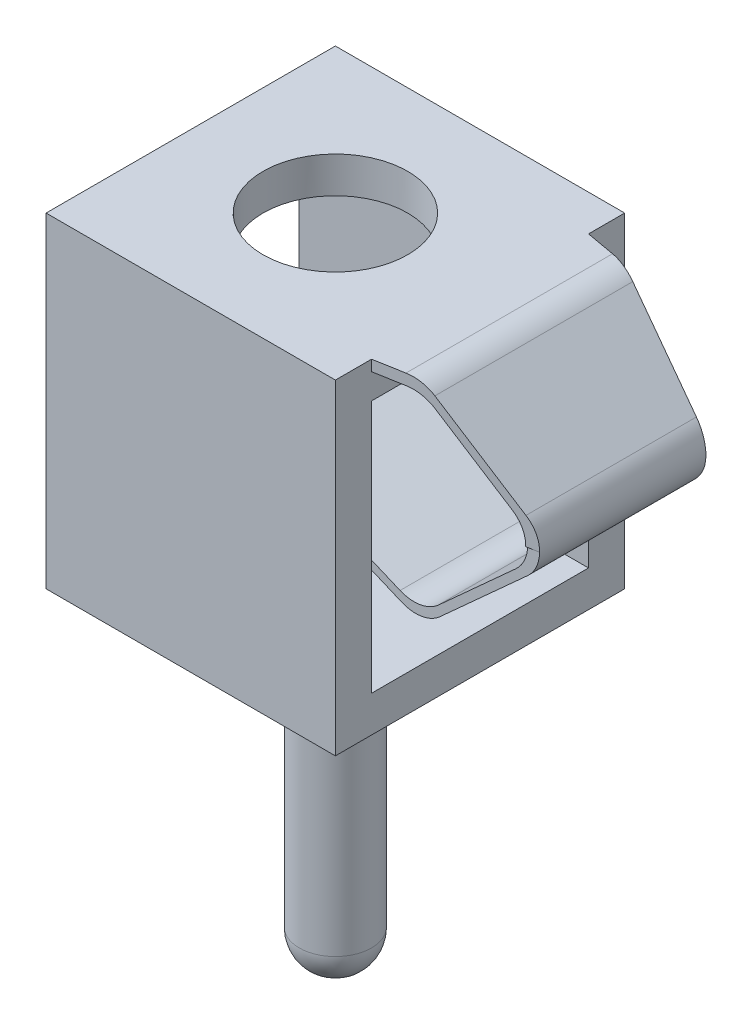
ISO-10303-21;
HEADER;
FILE_DESCRIPTION(('STEP AP214'),'2;1');
FILE_NAME('part.step','',(''),(''),'','','');
FILE_SCHEMA(('AUTOMOTIVE_DESIGN { 1 0 10303 214 1 1 1 1 }'));
ENDSEC;
DATA;
#1=APPLICATION_CONTEXT('core data for automotive mechanical design processes');
#2=APPLICATION_PROTOCOL_DEFINITION('international standard','automotive_design',2000,#1);
#3=PRODUCT_CONTEXT('',#1,'mechanical');
#4=PRODUCT('Part','Part','',(#3));
#5=PRODUCT_RELATED_PRODUCT_CATEGORY('part','',(#4));
#6=PRODUCT_DEFINITION_FORMATION('','',#4);
#7=PRODUCT_DEFINITION_CONTEXT('part definition',#1,'design');
#8=PRODUCT_DEFINITION('design','',#6,#7);
#9=PRODUCT_DEFINITION_SHAPE('','',#8);
#10=(LENGTH_UNIT() NAMED_UNIT(*) SI_UNIT(.MILLI.,.METRE.));
#11=(NAMED_UNIT(*) PLANE_ANGLE_UNIT() SI_UNIT($,.RADIAN.));
#12=(NAMED_UNIT(*) SI_UNIT($,.STERADIAN.) SOLID_ANGLE_UNIT());
#13=UNCERTAINTY_MEASURE_WITH_UNIT(LENGTH_MEASURE(1.E-05),#10,'distance_accuracy_value','');
#14=(GEOMETRIC_REPRESENTATION_CONTEXT(3) GLOBAL_UNCERTAINTY_ASSIGNED_CONTEXT((#13)) GLOBAL_UNIT_ASSIGNED_CONTEXT((#10,
#11,#12)) REPRESENTATION_CONTEXT('',''));
#15=CARTESIAN_POINT('',(0.,0.,0.));
#16=DIRECTION('',(0.,0.,1.));
#17=DIRECTION('',(1.,0.,0.));
#18=AXIS2_PLACEMENT_3D('',#15,#16,#17);
#19=CARTESIAN_POINT('',(5.47325224870173,0.758594498832904,-6.85820493129034));
#20=DIRECTION('',(0.,0.,1.));
#21=DIRECTION('',(1.,0.,0.));
#22=AXIS2_PLACEMENT_3D('',#19,#20,#21);
#23=CYLINDRICAL_SURFACE('',#22,0.500000000000002);
#24=DIRECTION('',(0.,0.,1.));
#25=VECTOR('',#24,1.);
#26=CARTESIAN_POINT('',(5.80889638246924,0.387996312831595,-6.85820493129034));
#27=LINE('',#26,#25);
#28=CARTESIAN_POINT('',(5.80889638246924,0.387996312831597,-1.15001310263475));
#29=VERTEX_POINT('',#28);
#30=CARTESIAN_POINT('',(5.80889638246924,0.387996312831597,1.15001310263475));
#31=VERTEX_POINT('',#30);
#32=EDGE_CURVE('E251',#29,#31,#27,.T.);
#33=ORIENTED_EDGE('',*,*,#32,.F.);
#34=CARTESIAN_POINT('',(5.47325224870173,0.758594498832904,-1.15001310263475));
#35=DIRECTION('',(0.,0.,-1.));
#36=DIRECTION('',(0.,1.,0.));
#37=AXIS2_PLACEMENT_3D('',#34,#35,#36);
#38=CIRCLE('',#37,0.500000000000002);
#39=CARTESIAN_POINT('',(5.97317837783464,0.75,-1.15001310263475));
#40=VERTEX_POINT('',#39);
#41=EDGE_CURVE('E238',#29,#40,#38,.F.);
#42=ORIENTED_EDGE('',*,*,#41,.T.);
#43=CARTESIAN_POINT('',(5.47325224870173,0.758594498832904,-1.23868607655972));
#44=DIRECTION('',(-0.174646166467987,0.,0.984631259171694));
#45=DIRECTION('',(0.984631259171694,0.,0.174646166467987));
#46=AXIS2_PLACEMENT_3D('',#43,#44,#45);
#47=ELLIPSE('',#46,0.507804312876091,0.500000000000002);
#48=CARTESIAN_POINT('',(5.81318688294126,1.12526116549957,-1.17839113856479));
#49=VERTEX_POINT('',#48);
#50=EDGE_CURVE('E248',#49,#40,#47,.F.);
#51=ORIENTED_EDGE('',*,*,#50,.F.);
#52=DIRECTION('',(0.,0.,1.));
#53=VECTOR('',#52,1.);
#54=CARTESIAN_POINT('',(5.81318688294126,1.12526116549957,-6.85820493129034));
#55=LINE('',#54,#53);
#56=CARTESIAN_POINT('',(5.81318688294126,1.12526116549957,1.17839113856479));
#57=VERTEX_POINT('',#56);
#58=EDGE_CURVE('E289',#49,#57,#55,.T.);
#59=ORIENTED_EDGE('',*,*,#58,.T.);
#60=CARTESIAN_POINT('',(5.47325224870173,0.758594498832904,1.23868607655972));
#61=DIRECTION('',(-0.174646166467987,0.,-0.984631259171694));
#62=DIRECTION('',(-0.984631259171694,0.,0.174646166467987));
#63=AXIS2_PLACEMENT_3D('',#60,#61,#62);
#64=ELLIPSE('',#63,0.507804312876091,0.500000000000002);
#65=CARTESIAN_POINT('',(5.97317837783464,0.75,1.15001310263475));
#66=VERTEX_POINT('',#65);
#67=EDGE_CURVE('E579',#66,#57,#64,.F.);
#68=ORIENTED_EDGE('',*,*,#67,.F.);
#69=CARTESIAN_POINT('',(5.47325224870173,0.758594498832904,1.15001310263475));
#70=DIRECTION('',(0.,0.,1.));
#71=DIRECTION('',(0.,-1.,0.));
#72=AXIS2_PLACEMENT_3D('',#69,#70,#71);
#73=CIRCLE('',#72,0.500000000000002);
#74=EDGE_CURVE('E614',#66,#31,#73,.F.);
#75=ORIENTED_EDGE('',*,*,#74,.T.);
#76=EDGE_LOOP('',(#33,#42,#51,#59,#68,#75));
#77=FACE_BOUND('',#76,.T.);
#78=ADVANCED_FACE('F38',(#77),#23,.T.);
#79=CARTESIAN_POINT('',(5.80889638246924,0.387996312831597,-6.85820493129034));
#80=DIRECTION('',(0.671288267535008,-0.741196372002621,0.));
#81=DIRECTION('',(0.741196372002621,0.671288267535008,0.));
#82=AXIS2_PLACEMENT_3D('',#79,#80,#81);
#83=PLANE('',#82);
#84=DIRECTION('',(0.,0.,1.));
#85=VECTOR('',#84,1.);
#86=CARTESIAN_POINT('',(4.59643948633741,-0.710104163653645,-6.85820493129034));
#87=LINE('',#86,#85);
#88=CARTESIAN_POINT('',(4.59643948633741,-0.710104163653642,-1.15001310263475));
#89=VERTEX_POINT('',#88);
#90=CARTESIAN_POINT('',(4.59643948633741,-0.710104163653642,1.15001310263475));
#91=VERTEX_POINT('',#90);
#92=EDGE_CURVE('E294',#89,#91,#87,.T.);
#93=ORIENTED_EDGE('',*,*,#92,.F.);
#94=DIRECTION('',(0.741196372002621,0.671288267535008,0.));
#95=VECTOR('',#94,1.);
#96=CARTESIAN_POINT('',(5.80889638246924,0.387996312831596,-1.15001310263475));
#97=LINE('',#96,#95);
#98=EDGE_CURVE('E253',#89,#29,#97,.T.);
#99=ORIENTED_EDGE('',*,*,#98,.T.);
#100=ORIENTED_EDGE('',*,*,#32,.T.);
#101=DIRECTION('',(-0.741196372002621,-0.671288267535008,0.));
#102=VECTOR('',#101,1.);
#103=CARTESIAN_POINT('',(5.80889638246924,0.387996312831596,1.15001310263475));
#104=LINE('',#103,#102);
#105=EDGE_CURVE('E617',#31,#91,#104,.T.);
#106=ORIENTED_EDGE('',*,*,#105,.T.);
#107=EDGE_LOOP('',(#93,#99,#100,#106));
#108=FACE_BOUND('',#107,.T.);
#109=ADVANCED_FACE('F439',(#108),#83,.T.);
#110=CARTESIAN_POINT('',(4.2607953525699,-0.339505977652333,-6.85820493129034));
#111=DIRECTION('',(0.,0.,1.));
#112=DIRECTION('',(1.,0.,0.));
#113=AXIS2_PLACEMENT_3D('',#110,#111,#112);
#114=CYLINDRICAL_SURFACE('',#113,0.500000000000002);
#115=DIRECTION('',(0.,0.,1.));
#116=VECTOR('',#115,1.);
#117=CARTESIAN_POINT('',(4.06676867111155,-0.800324430931128,-6.85820493129034));
#118=LINE('',#117,#116);
#119=CARTESIAN_POINT('',(4.06676867111155,-0.800324430931124,-1.15001310263475));
#120=VERTEX_POINT('',#119);
#121=CARTESIAN_POINT('',(4.06676867111155,-0.800324430931124,1.15001310263475));
#122=VERTEX_POINT('',#121);
#123=EDGE_CURVE('E297',#120,#122,#118,.T.);
#124=ORIENTED_EDGE('',*,*,#123,.F.);
#125=CARTESIAN_POINT('',(4.2607953525699,-0.339505977652333,-1.15001310263475));
#126=DIRECTION('',(0.,0.,-1.));
#127=DIRECTION('',(0.,1.,0.));
#128=AXIS2_PLACEMENT_3D('',#125,#126,#127);
#129=CIRCLE('',#128,0.500000000000002);
#130=EDGE_CURVE('E547',#120,#89,#129,.F.);
#131=ORIENTED_EDGE('',*,*,#130,.T.);
#132=ORIENTED_EDGE('',*,*,#92,.T.);
#133=CARTESIAN_POINT('',(4.2607953525699,-0.339505977652333,1.15001310263475));
#134=DIRECTION('',(0.,0.,1.));
#135=DIRECTION('',(0.,-1.,0.));
#136=AXIS2_PLACEMENT_3D('',#133,#134,#135);
#137=CIRCLE('',#136,0.500000000000002);
#138=EDGE_CURVE('E620',#91,#122,#137,.F.);
#139=ORIENTED_EDGE('',*,*,#138,.T.);
#140=EDGE_LOOP('',(#124,#131,#132,#139));
#141=FACE_BOUND('',#140,.T.);
#142=ADVANCED_FACE('F444',(#141),#114,.T.);
#143=CARTESIAN_POINT('',(4.06676867111155,-0.800324430931125,-6.85820493129034));
#144=DIRECTION('',(-0.38805336291672,-0.921636906557579,0.));
#145=DIRECTION('',(0.921636906557579,-0.38805336291672,0.));
#146=AXIS2_PLACEMENT_3D('',#143,#144,#145);
#147=PLANE('',#146);
#148=DIRECTION('',(0.,0.,1.));
#149=VECTOR('',#148,1.);
#150=CARTESIAN_POINT('',(1.59543168365403,0.240227029258746,-6.85820493129034));
#151=LINE('',#150,#149);
#152=CARTESIAN_POINT('',(1.59543168365403,0.240227029258746,-1.15001310263475));
#153=VERTEX_POINT('',#152);
#154=CARTESIAN_POINT('',(1.59543168365403,0.240227029258746,1.15001310263475));
#155=VERTEX_POINT('',#154);
#156=EDGE_CURVE('E300',#153,#155,#151,.T.);
#157=ORIENTED_EDGE('',*,*,#156,.F.);
#158=DIRECTION('',(0.921636906557579,-0.38805336291672,0.));
#159=VECTOR('',#158,1.);
#160=CARTESIAN_POINT('',(4.06676867111155,-0.800324430931125,-1.15001310263475));
#161=LINE('',#160,#159);
#162=EDGE_CURVE('E557',#153,#120,#161,.T.);
#163=ORIENTED_EDGE('',*,*,#162,.T.);
#164=ORIENTED_EDGE('',*,*,#123,.T.);
#165=DIRECTION('',(-0.921636906557579,0.38805336291672,0.));
#166=VECTOR('',#165,1.);
#167=CARTESIAN_POINT('',(4.06676867111155,-0.800324430931125,1.15001310263475));
#168=LINE('',#167,#166);
#169=EDGE_CURVE('E624',#122,#155,#168,.T.);
#170=ORIENTED_EDGE('',*,*,#169,.T.);
#171=EDGE_LOOP('',(#157,#163,#164,#170));
#172=FACE_BOUND('',#171,.T.);
#173=ADVANCED_FACE('F453',(#172),#147,.T.);
#174=CARTESIAN_POINT('',(1.59543168365403,0.359579888521796,-6.85820493129034));
#175=DIRECTION('',(-1.,0.,0.));
#176=DIRECTION('',(0.,0.,1.));
#177=AXIS2_PLACEMENT_3D('',#174,#175,#176);
#178=PLANE('',#177);
#179=DIRECTION('',(0.,0.,1.));
#180=VECTOR('',#179,1.);
#181=CARTESIAN_POINT('',(1.59543168365403,0.359579888521796,-6.85820493129034));
#182=LINE('',#181,#180);
#183=CARTESIAN_POINT('',(1.59543168365403,0.359579888521796,-1.15001310263475));
#184=VERTEX_POINT('',#183);
#185=CARTESIAN_POINT('',(1.59543168365403,0.359579888521796,1.15001310263475));
#186=VERTEX_POINT('',#185);
#187=EDGE_CURVE('E303',#184,#186,#182,.T.);
#188=ORIENTED_EDGE('',*,*,#187,.F.);
#189=DIRECTION('',(0.,-1.,0.));
#190=VECTOR('',#189,1.);
#191=CARTESIAN_POINT('',(1.59543168365403,0.359579888521796,-1.15001310263475));
#192=LINE('',#191,#190);
#193=EDGE_CURVE('E559',#184,#153,#192,.T.);
#194=ORIENTED_EDGE('',*,*,#193,.T.);
#195=ORIENTED_EDGE('',*,*,#156,.T.);
#196=DIRECTION('',(0.,1.,0.));
#197=VECTOR('',#196,1.);
#198=CARTESIAN_POINT('',(1.59543168365403,0.359579888521795,1.15001310263475));
#199=LINE('',#198,#197);
#200=EDGE_CURVE('E628',#155,#186,#199,.T.);
#201=ORIENTED_EDGE('',*,*,#200,.T.);
#202=EDGE_LOOP('',(#188,#194,#195,#201));
#203=FACE_BOUND('',#202,.T.);
#204=ADVANCED_FACE('F457',(#203),#178,.T.);
#205=CARTESIAN_POINT('',(4.04486831994504,-0.671750472926527,-6.85820493129034));
#206=DIRECTION('',(0.38805336291672,0.92163690655758,0.));
#207=DIRECTION('',(-0.92163690655758,0.38805336291672,0.));
#208=AXIS2_PLACEMENT_3D('',#205,#206,#207);
#209=PLANE('',#208);
#210=DIRECTION('',(0.,0.,1.));
#211=VECTOR('',#210,1.);
#212=CARTESIAN_POINT('',(4.04486831994504,-0.671750472926527,-6.85820493129034));
#213=LINE('',#212,#211);
#214=CARTESIAN_POINT('',(4.04486831994504,-0.671750472926531,-1.15001310263475));
#215=VERTEX_POINT('',#214);
#216=CARTESIAN_POINT('',(4.04486831994504,-0.67175047292653,1.15001310263475));
#217=VERTEX_POINT('',#216);
#218=EDGE_CURVE('E305',#215,#217,#213,.T.);
#219=ORIENTED_EDGE('',*,*,#218,.F.);
#220=DIRECTION('',(-0.92163690655758,0.38805336291672,0.));
#221=VECTOR('',#220,1.);
#222=CARTESIAN_POINT('',(4.04486831994504,-0.671750472926527,-1.15001310263475));
#223=LINE('',#222,#221);
#224=EDGE_CURVE('E653',#215,#184,#223,.T.);
#225=ORIENTED_EDGE('',*,*,#224,.T.);
#226=ORIENTED_EDGE('',*,*,#187,.T.);
#227=DIRECTION('',(0.92163690655758,-0.38805336291672,0.));
#228=VECTOR('',#227,1.);
#229=CARTESIAN_POINT('',(4.04486831994504,-0.671750472926527,1.15001310263475));
#230=LINE('',#229,#228);
#231=EDGE_CURVE('E568',#186,#217,#230,.T.);
#232=ORIENTED_EDGE('',*,*,#231,.T.);
#233=EDGE_LOOP('',(#219,#225,#226,#232));
#234=FACE_BOUND('',#233,.T.);
#235=ADVANCED_FACE('F461',(#234),#209,.T.);
#236=CARTESIAN_POINT('',(4.23889500140339,-0.210932019647736,-6.85820493129034));
#237=DIRECTION('',(0.,0.,1.));
#238=DIRECTION('',(1.,0.,0.));
#239=AXIS2_PLACEMENT_3D('',#236,#237,#238);
#240=CYLINDRICAL_SURFACE('',#239,0.500000000000002);
#241=DIRECTION('',(0.,0.,1.));
#242=VECTOR('',#241,1.);
#243=CARTESIAN_POINT('',(4.5745391351709,-0.581530205649044,-6.85820493129034));
#244=LINE('',#243,#242);
#245=CARTESIAN_POINT('',(4.5745391351709,-0.58153020564905,-1.15001310263475));
#246=VERTEX_POINT('',#245);
#247=CARTESIAN_POINT('',(4.5745391351709,-0.58153020564905,1.15001310263475));
#248=VERTEX_POINT('',#247);
#249=EDGE_CURVE('E308',#246,#248,#244,.T.);
#250=ORIENTED_EDGE('',*,*,#249,.F.);
#251=CARTESIAN_POINT('',(4.23889500140339,-0.210932019647736,-1.15001310263475));
#252=DIRECTION('',(0.,0.,-1.));
#253=DIRECTION('',(0.,1.,0.));
#254=AXIS2_PLACEMENT_3D('',#251,#252,#253);
#255=CIRCLE('',#254,0.500000000000002);
#256=EDGE_CURVE('E657',#246,#215,#255,.T.);
#257=ORIENTED_EDGE('',*,*,#256,.T.);
#258=ORIENTED_EDGE('',*,*,#218,.T.);
#259=CARTESIAN_POINT('',(4.23889500140339,-0.210932019647736,1.15001310263475));
#260=DIRECTION('',(0.,0.,1.));
#261=DIRECTION('',(0.,-1.,0.));
#262=AXIS2_PLACEMENT_3D('',#259,#260,#261);
#263=CIRCLE('',#262,0.500000000000002);
#264=EDGE_CURVE('E565',#217,#248,#263,.T.);
#265=ORIENTED_EDGE('',*,*,#264,.T.);
#266=EDGE_LOOP('',(#250,#257,#258,#265));
#267=FACE_BOUND('',#266,.T.);
#268=ADVANCED_FACE('F465',(#267),#240,.F.);
#269=CARTESIAN_POINT('',(5.64607854385029,0.388943828518693,-6.85820493129034));
#270=DIRECTION('',(-0.671288267535009,0.74119637200262,0.));
#271=DIRECTION('',(-0.74119637200262,-0.671288267535009,0.));
#272=AXIS2_PLACEMENT_3D('',#269,#270,#271);
#273=PLANE('',#272);
#274=DIRECTION('',(0.,0.,1.));
#275=VECTOR('',#274,1.);
#276=CARTESIAN_POINT('',(5.64607854385029,0.388943828518693,-6.85820493129034));
#277=LINE('',#276,#275);
#278=CARTESIAN_POINT('',(5.64607854385029,0.388943828518692,-1.15001310263475));
#279=VERTEX_POINT('',#278);
#280=CARTESIAN_POINT('',(5.64607854385029,0.388943828518692,1.15001310263475));
#281=VERTEX_POINT('',#280);
#282=EDGE_CURVE('E311',#279,#281,#277,.T.);
#283=ORIENTED_EDGE('',*,*,#282,.F.);
#284=DIRECTION('',(-0.74119637200262,-0.671288267535009,0.));
#285=VECTOR('',#284,1.);
#286=CARTESIAN_POINT('',(5.64607854385029,0.388943828518692,-1.15001310263475));
#287=LINE('',#286,#285);
#288=EDGE_CURVE('E563',#279,#246,#287,.T.);
#289=ORIENTED_EDGE('',*,*,#288,.T.);
#290=ORIENTED_EDGE('',*,*,#249,.T.);
#291=DIRECTION('',(0.74119637200262,0.671288267535009,0.));
#292=VECTOR('',#291,1.);
#293=CARTESIAN_POINT('',(5.64607854385029,0.388943828518692,1.15001310263475));
#294=LINE('',#293,#292);
#295=EDGE_CURVE('E569',#248,#281,#294,.T.);
#296=ORIENTED_EDGE('',*,*,#295,.T.);
#297=EDGE_LOOP('',(#283,#289,#290,#296));
#298=FACE_BOUND('',#297,.T.);
#299=ADVANCED_FACE('F433',(#298),#273,.T.);
#300=CARTESIAN_POINT('',(5.31043441008278,0.759542014520001,-6.85820493129034));
#301=DIRECTION('',(0.,0.,1.));
#302=DIRECTION('',(1.,0.,0.));
#303=AXIS2_PLACEMENT_3D('',#300,#301,#302);
#304=CYLINDRICAL_SURFACE('',#303,0.500000000000002);
#305=DIRECTION('',(0.,0.,1.));
#306=VECTOR('',#305,1.);
#307=CARTESIAN_POINT('',(5.81034335175007,0.75,-6.85820493129034));
#308=LINE('',#307,#306);
#309=CARTESIAN_POINT('',(5.81034335175007,0.75,-1.17889550181463));
#310=VERTEX_POINT('',#309);
#311=CARTESIAN_POINT('',(5.81034335175007,0.75,-1.15001310263475));
#312=VERTEX_POINT('',#311);
#313=EDGE_CURVE('E227',#310,#312,#308,.T.);
#314=ORIENTED_EDGE('',*,*,#313,.T.);
#315=CARTESIAN_POINT('',(5.31043441008278,0.759542014520001,-1.15001310263475));
#316=DIRECTION('',(0.,0.,-1.));
#317=DIRECTION('',(0.,1.,0.));
#318=AXIS2_PLACEMENT_3D('',#315,#316,#317);
#319=CIRCLE('',#318,0.500000000000002);
#320=EDGE_CURVE('E241',#312,#279,#319,.T.);
#321=ORIENTED_EDGE('',*,*,#320,.T.);
#322=ORIENTED_EDGE('',*,*,#282,.T.);
#323=CARTESIAN_POINT('',(5.31043441008278,0.759542014520001,1.15001310263475));
#324=DIRECTION('',(0.,0.,1.));
#325=DIRECTION('',(0.,-1.,0.));
#326=AXIS2_PLACEMENT_3D('',#323,#324,#325);
#327=CIRCLE('',#326,0.500000000000002);
#328=CARTESIAN_POINT('',(5.81034335175007,0.75,1.15001310263475));
#329=VERTEX_POINT('',#328);
#330=EDGE_CURVE('E638',#281,#329,#327,.T.);
#331=ORIENTED_EDGE('',*,*,#330,.T.);
#332=DIRECTION('',(0.,0.,1.));
#333=VECTOR('',#332,1.);
#334=CARTESIAN_POINT('',(5.81034335175007,0.75,-6.85820493129034));
#335=LINE('',#334,#333);
#336=CARTESIAN_POINT('',(5.81034335175007,0.75,1.17889550181463));
#337=VERTEX_POINT('',#336);
#338=EDGE_CURVE('E610',#329,#337,#335,.T.);
#339=ORIENTED_EDGE('',*,*,#338,.T.);
#340=CARTESIAN_POINT('',(5.31043441008278,0.759542014520001,1.26756542716182));
#341=DIRECTION('',(-0.174646166467987,0.,-0.984631259171694));
#342=DIRECTION('',(-0.984631259171694,0.,0.174646166467987));
#343=AXIS2_PLACEMENT_3D('',#340,#341,#342);
#344=ELLIPSE('',#343,0.50780431287609,0.500000000000002);
#345=CARTESIAN_POINT('',(5.65036904432231,1.12620868118667,1.20727048916688));
#346=VERTEX_POINT('',#345);
#347=EDGE_CURVE('E573',#346,#337,#344,.T.);
#348=ORIENTED_EDGE('',*,*,#347,.F.);
#349=DIRECTION('',(0.,0.,1.));
#350=VECTOR('',#349,1.);
#351=CARTESIAN_POINT('',(5.65036904432231,1.12620868118667,-6.85820493129034));
#352=LINE('',#351,#350);
#353=CARTESIAN_POINT('',(5.65036904432231,1.12620868118667,-1.20727048916688));
#354=VERTEX_POINT('',#353);
#355=EDGE_CURVE('E314',#354,#346,#352,.T.);
#356=ORIENTED_EDGE('',*,*,#355,.F.);
#357=CARTESIAN_POINT('',(5.31043441008278,0.759542014520001,-1.26756542716182));
#358=DIRECTION('',(-0.174646166467987,0.,0.984631259171694));
#359=DIRECTION('',(0.984631259171694,0.,0.174646166467987));
#360=AXIS2_PLACEMENT_3D('',#357,#358,#359);
#361=ELLIPSE('',#360,0.50780431287609,0.500000000000002);
#362=EDGE_CURVE('E259',#310,#354,#361,.T.);
#363=ORIENTED_EDGE('',*,*,#362,.F.);
#364=EDGE_LOOP('',(#314,#321,#322,#331,#339,#348,#356,#363));
#365=FACE_BOUND('',#364,.T.);
#366=ADVANCED_FACE('F423',(#365),#304,.F.);
#367=CARTESIAN_POINT('',(4.,-2.25,2.));
#368=DIRECTION('',(0.,1.,0.));
#369=DIRECTION('',(0.,0.,1.));
#370=AXIS2_PLACEMENT_3D('',#367,#368,#369);
#371=PLANE('',#370);
#372=DIRECTION('',(0.,0.,-1.));
#373=VECTOR('',#372,1.);
#374=CARTESIAN_POINT('',(0.,-2.25,2.));
#375=LINE('',#374,#373);
#376=CARTESIAN_POINT('',(0.,-2.25,2.));
#377=VERTEX_POINT('',#376);
#378=CARTESIAN_POINT('',(0.,-2.25,-2.));
#379=VERTEX_POINT('',#378);
#380=EDGE_CURVE('E374',#377,#379,#375,.T.);
#381=ORIENTED_EDGE('',*,*,#380,.T.);
#382=DIRECTION('',(-1.,0.,0.));
#383=VECTOR('',#382,1.);
#384=CARTESIAN_POINT('',(4.,-2.25,-2.));
#385=LINE('',#384,#383);
#386=CARTESIAN_POINT('',(4.,-2.25,-2.));
#387=VERTEX_POINT('',#386);
#388=EDGE_CURVE('E385',#387,#379,#385,.T.);
#389=ORIENTED_EDGE('',*,*,#388,.F.);
#390=DIRECTION('',(0.,0.,-1.));
#391=VECTOR('',#390,1.);
#392=CARTESIAN_POINT('',(4.,-2.25,2.));
#393=LINE('',#392,#391);
#394=CARTESIAN_POINT('',(4.,-2.25,2.));
#395=VERTEX_POINT('',#394);
#396=EDGE_CURVE('E382',#395,#387,#393,.T.);
#397=ORIENTED_EDGE('',*,*,#396,.F.);
#398=DIRECTION('',(-1.,0.,0.));
#399=VECTOR('',#398,1.);
#400=CARTESIAN_POINT('',(4.,-2.25,2.));
#401=LINE('',#400,#399);
#402=EDGE_CURVE('E400',#395,#377,#401,.T.);
#403=ORIENTED_EDGE('',*,*,#402,.T.);
#404=EDGE_LOOP('',(#381,#389,#397,#403));
#405=FACE_BOUND('',#404,.T.);
#406=CARTESIAN_POINT('',(2.,-2.25,0.));
#407=DIRECTION('',(0.,1.,0.));
#408=DIRECTION('',(0.,0.,1.));
#409=AXIS2_PLACEMENT_3D('',#406,#407,#408);
#410=CIRCLE('',#409,0.5);
#411=CARTESIAN_POINT('',(2.,-2.25,0.5));
#412=VERTEX_POINT('',#411);
#413=EDGE_CURVE('E48',#412,#412,#410,.F.);
#414=ORIENTED_EDGE('',*,*,#413,.F.);
#415=EDGE_LOOP('',(#414));
#416=FACE_BOUND('',#415,.T.);
#417=ADVANCED_FACE('F420',(#405,#416),#371,.F.);
#418=CARTESIAN_POINT('',(4.,0.,0.));
#419=DIRECTION('',(1.,0.,0.));
#420=DIRECTION('',(0.,0.,-1.));
#421=AXIS2_PLACEMENT_3D('',#418,#419,#420);
#422=PLANE('',#421);
#423=DIRECTION('',(0.,0.,1.));
#424=VECTOR('',#423,1.);
#425=CARTESIAN_POINT('',(4.,2.1,-6.85820493129034));
#426=LINE('',#425,#424);
#427=CARTESIAN_POINT('',(4.,2.1,-1.5));
#428=VERTEX_POINT('',#427);
#429=CARTESIAN_POINT('',(4.,2.1,1.5));
#430=VERTEX_POINT('',#429);
#431=EDGE_CURVE('E281',#428,#430,#426,.T.);
#432=ORIENTED_EDGE('',*,*,#431,.T.);
#433=DIRECTION('',(0.,-1.,0.));
#434=VECTOR('',#433,1.);
#435=CARTESIAN_POINT('',(4.,2.25,1.5));
#436=LINE('',#435,#434);
#437=CARTESIAN_POINT('',(4.,2.25,1.5));
#438=VERTEX_POINT('',#437);
#439=EDGE_CURVE('E273',#438,#430,#436,.T.);
#440=ORIENTED_EDGE('',*,*,#439,.F.);
#441=DIRECTION('',(0.,0.,1.));
#442=VECTOR('',#441,1.);
#443=CARTESIAN_POINT('',(4.,2.25,2.));
#444=LINE('',#443,#442);
#445=CARTESIAN_POINT('',(4.,2.25,2.));
#446=VERTEX_POINT('',#445);
#447=EDGE_CURVE('E373',#438,#446,#444,.T.);
#448=ORIENTED_EDGE('',*,*,#447,.T.);
#449=DIRECTION('',(0.,-1.,0.));
#450=VECTOR('',#449,1.);
#451=CARTESIAN_POINT('',(4.,2.25,2.));
#452=LINE('',#451,#450);
#453=EDGE_CURVE('E379',#446,#395,#452,.T.);
#454=ORIENTED_EDGE('',*,*,#453,.T.);
#455=ORIENTED_EDGE('',*,*,#396,.T.);
#456=DIRECTION('',(0.,1.,0.));
#457=VECTOR('',#456,1.);
#458=CARTESIAN_POINT('',(4.,2.25,-2.));
#459=LINE('',#458,#457);
#460=CARTESIAN_POINT('',(4.,2.25,-2.));
#461=VERTEX_POINT('',#460);
#462=EDGE_CURVE('E369',#387,#461,#459,.T.);
#463=ORIENTED_EDGE('',*,*,#462,.T.);
#464=CARTESIAN_POINT('',(4.,2.25,-1.5));
#465=VERTEX_POINT('',#464);
#466=EDGE_CURVE('E375',#461,#465,#444,.T.);
#467=ORIENTED_EDGE('',*,*,#466,.T.);
#468=DIRECTION('',(0.,1.,0.));
#469=VECTOR('',#468,1.);
#470=CARTESIAN_POINT('',(4.,2.25,-1.5));
#471=LINE('',#470,#469);
#472=EDGE_CURVE('E274',#428,#465,#471,.T.);
#473=ORIENTED_EDGE('',*,*,#472,.F.);
#474=EDGE_LOOP('',(#432,#440,#448,#454,#455,#463,#467,#473));
#475=FACE_BOUND('',#474,.T.);
#476=DIRECTION('',(0.,0.,1.));
#477=VECTOR('',#476,1.);
#478=CARTESIAN_POINT('',(4.,1.75,1.5));
#479=LINE('',#478,#477);
#480=CARTESIAN_POINT('',(4.,1.75,-1.5));
#481=VERTEX_POINT('',#480);
#482=CARTESIAN_POINT('',(4.,1.75,1.5));
#483=VERTEX_POINT('',#482);
#484=EDGE_CURVE('E335',#481,#483,#479,.T.);
#485=ORIENTED_EDGE('',*,*,#484,.F.);
#486=DIRECTION('',(0.,1.,0.));
#487=VECTOR('',#486,1.);
#488=CARTESIAN_POINT('',(4.,1.75,-1.5));
#489=LINE('',#488,#487);
#490=CARTESIAN_POINT('',(4.,-1.75,-1.5));
#491=VERTEX_POINT('',#490);
#492=EDGE_CURVE('E332',#491,#481,#489,.T.);
#493=ORIENTED_EDGE('',*,*,#492,.F.);
#494=DIRECTION('',(0.,0.,-1.));
#495=VECTOR('',#494,1.);
#496=CARTESIAN_POINT('',(4.,-1.75,1.5));
#497=LINE('',#496,#495);
#498=CARTESIAN_POINT('',(4.,-1.75,1.5));
#499=VERTEX_POINT('',#498);
#500=EDGE_CURVE('E341',#499,#491,#497,.T.);
#501=ORIENTED_EDGE('',*,*,#500,.F.);
#502=DIRECTION('',(0.,-1.,0.));
#503=VECTOR('',#502,1.);
#504=CARTESIAN_POINT('',(4.,1.75,1.5));
#505=LINE('',#504,#503);
#506=EDGE_CURVE('E55',#483,#499,#505,.T.);
#507=ORIENTED_EDGE('',*,*,#506,.F.);
#508=EDGE_LOOP('',(#485,#493,#501,#507));
#509=FACE_BOUND('',#508,.T.);
#510=ADVANCED_FACE('F422',(#475,#509),#422,.T.);
#511=CARTESIAN_POINT('',(0.,0.,0.));
#512=DIRECTION('',(1.,0.,0.));
#513=DIRECTION('',(0.,0.,-1.));
#514=AXIS2_PLACEMENT_3D('',#511,#512,#513);
#515=PLANE('',#514);
#516=DIRECTION('',(0.,1.,0.));
#517=VECTOR('',#516,1.);
#518=CARTESIAN_POINT('',(0.,2.25,-2.));
#519=LINE('',#518,#517);
#520=CARTESIAN_POINT('',(0.,2.25,-2.));
#521=VERTEX_POINT('',#520);
#522=EDGE_CURVE('E368',#379,#521,#519,.T.);
#523=ORIENTED_EDGE('',*,*,#522,.F.);
#524=ORIENTED_EDGE('',*,*,#380,.F.);
#525=DIRECTION('',(0.,-1.,0.));
#526=VECTOR('',#525,1.);
#527=CARTESIAN_POINT('',(0.,2.25,2.));
#528=LINE('',#527,#526);
#529=CARTESIAN_POINT('',(0.,2.25,2.));
#530=VERTEX_POINT('',#529);
#531=EDGE_CURVE('E392',#530,#377,#528,.T.);
#532=ORIENTED_EDGE('',*,*,#531,.F.);
#533=DIRECTION('',(0.,0.,1.));
#534=VECTOR('',#533,1.);
#535=CARTESIAN_POINT('',(0.,2.25,2.));
#536=LINE('',#535,#534);
#537=EDGE_CURVE('E389',#521,#530,#536,.T.);
#538=ORIENTED_EDGE('',*,*,#537,.F.);
#539=EDGE_LOOP('',(#523,#524,#532,#538));
#540=FACE_BOUND('',#539,.T.);
#541=DIRECTION('',(0.,1.,0.));
#542=VECTOR('',#541,1.);
#543=CARTESIAN_POINT('',(0.,1.75,-1.5));
#544=LINE('',#543,#542);
#545=CARTESIAN_POINT('',(0.,-1.75,-1.5));
#546=VERTEX_POINT('',#545);
#547=CARTESIAN_POINT('',(0.,1.75,-1.5));
#548=VERTEX_POINT('',#547);
#549=EDGE_CURVE('E63',#546,#548,#544,.T.);
#550=ORIENTED_EDGE('',*,*,#549,.T.);
#551=DIRECTION('',(0.,0.,1.));
#552=VECTOR('',#551,1.);
#553=CARTESIAN_POINT('',(0.,1.75,1.5));
#554=LINE('',#553,#552);
#555=CARTESIAN_POINT('',(0.,1.75,1.5));
#556=VERTEX_POINT('',#555);
#557=EDGE_CURVE('E347',#548,#556,#554,.T.);
#558=ORIENTED_EDGE('',*,*,#557,.T.);
#559=DIRECTION('',(0.,-1.,0.));
#560=VECTOR('',#559,1.);
#561=CARTESIAN_POINT('',(0.,1.75,1.5));
#562=LINE('',#561,#560);
#563=CARTESIAN_POINT('',(0.,-1.75,1.5));
#564=VERTEX_POINT('',#563);
#565=EDGE_CURVE('E351',#556,#564,#562,.T.);
#566=ORIENTED_EDGE('',*,*,#565,.T.);
#567=DIRECTION('',(0.,0.,-1.));
#568=VECTOR('',#567,1.);
#569=CARTESIAN_POINT('',(0.,-1.75,1.5));
#570=LINE('',#569,#568);
#571=EDGE_CURVE('E336',#564,#546,#570,.T.);
#572=ORIENTED_EDGE('',*,*,#571,.T.);
#573=EDGE_LOOP('',(#550,#558,#566,#572));
#574=FACE_BOUND('',#573,.T.);
#575=ADVANCED_FACE('F430',(#540,#574),#515,.F.);
#576=CARTESIAN_POINT('',(4.,2.25,-2.));
#577=DIRECTION('',(0.,0.,1.));
#578=DIRECTION('',(0.,-1.,0.));
#579=AXIS2_PLACEMENT_3D('',#576,#577,#578);
#580=PLANE('',#579);
#581=ORIENTED_EDGE('',*,*,#522,.T.);
#582=DIRECTION('',(-1.,0.,0.));
#583=VECTOR('',#582,1.);
#584=CARTESIAN_POINT('',(4.,2.25,-2.));
#585=LINE('',#584,#583);
#586=EDGE_CURVE('E408',#461,#521,#585,.T.);
#587=ORIENTED_EDGE('',*,*,#586,.F.);
#588=ORIENTED_EDGE('',*,*,#462,.F.);
#589=ORIENTED_EDGE('',*,*,#388,.T.);
#590=EDGE_LOOP('',(#581,#587,#588,#589));
#591=FACE_BOUND('',#590,.T.);
#592=ADVANCED_FACE('F508',(#591),#580,.F.);
#593=CARTESIAN_POINT('',(4.,2.25,2.));
#594=DIRECTION('',(0.,-1.,0.));
#595=DIRECTION('',(0.,0.,-1.));
#596=AXIS2_PLACEMENT_3D('',#593,#594,#595);
#597=PLANE('',#596);
#598=CARTESIAN_POINT('',(2.,2.25,0.));
#599=DIRECTION('',(0.,1.,0.));
#600=DIRECTION('',(0.,0.,1.));
#601=AXIS2_PLACEMENT_3D('',#598,#599,#600);
#602=CIRCLE('',#601,1.);
#603=CARTESIAN_POINT('',(2.,2.25,1.));
#604=VERTEX_POINT('',#603);
#605=EDGE_CURVE('E277',#604,#604,#602,.T.);
#606=ORIENTED_EDGE('',*,*,#605,.F.);
#607=EDGE_LOOP('',(#606));
#608=FACE_BOUND('',#607,.T.);
#609=ORIENTED_EDGE('',*,*,#447,.F.);
#610=DIRECTION('',(-0.984631259171694,0.,0.174646166467987));
#611=VECTOR('',#610,1.);
#612=CARTESIAN_POINT('',(4.,2.25,1.5));
#613=LINE('',#612,#611);
#614=CARTESIAN_POINT('',(4.40388386486181,2.25,1.42836224927926));
#615=VERTEX_POINT('',#614);
#616=EDGE_CURVE('E552',#615,#438,#613,.T.);
#617=ORIENTED_EDGE('',*,*,#616,.F.);
#618=DIRECTION('',(0.,0.,1.));
#619=VECTOR('',#618,1.);
#620=CARTESIAN_POINT('',(4.40388386486181,2.25,-6.85820493129034));
#621=LINE('',#620,#619);
#622=CARTESIAN_POINT('',(4.40388386486181,2.25,-1.42836224927926));
#623=VERTEX_POINT('',#622);
#624=EDGE_CURVE('E278',#623,#615,#621,.T.);
#625=ORIENTED_EDGE('',*,*,#624,.F.);
#626=DIRECTION('',(0.984631259171694,0.,0.174646166467987));
#627=VECTOR('',#626,1.);
#628=CARTESIAN_POINT('',(4.,2.25,-1.5));
#629=LINE('',#628,#627);
#630=EDGE_CURVE('E233',#465,#623,#629,.T.);
#631=ORIENTED_EDGE('',*,*,#630,.F.);
#632=ORIENTED_EDGE('',*,*,#466,.F.);
#633=ORIENTED_EDGE('',*,*,#586,.T.);
#634=ORIENTED_EDGE('',*,*,#537,.T.);
#635=DIRECTION('',(-1.,0.,0.));
#636=VECTOR('',#635,1.);
#637=CARTESIAN_POINT('',(4.,2.25,2.));
#638=LINE('',#637,#636);
#639=EDGE_CURVE('E404',#446,#530,#638,.T.);
#640=ORIENTED_EDGE('',*,*,#639,.F.);
#641=EDGE_LOOP('',(#609,#617,#625,#631,#632,#633,#634,#640));
#642=FACE_BOUND('',#641,.T.);
#643=ADVANCED_FACE('F513',(#608,#642),#597,.F.);
#644=CARTESIAN_POINT('',(4.,2.25,2.));
#645=DIRECTION('',(0.,0.,-1.));
#646=DIRECTION('',(0.,1.,0.));
#647=AXIS2_PLACEMENT_3D('',#644,#645,#646);
#648=PLANE('',#647);
#649=ORIENTED_EDGE('',*,*,#531,.T.);
#650=ORIENTED_EDGE('',*,*,#402,.F.);
#651=ORIENTED_EDGE('',*,*,#453,.F.);
#652=ORIENTED_EDGE('',*,*,#639,.T.);
#653=EDGE_LOOP('',(#649,#650,#651,#652));
#654=FACE_BOUND('',#653,.T.);
#655=ADVANCED_FACE('F506',(#654),#648,.F.);
#656=CARTESIAN_POINT('',(4.,1.75,-1.5));
#657=DIRECTION('',(0.,0.,1.));
#658=DIRECTION('',(0.,-1.,0.));
#659=AXIS2_PLACEMENT_3D('',#656,#657,#658);
#660=PLANE('',#659);
#661=DIRECTION('',(-1.,0.,0.));
#662=VECTOR('',#661,1.);
#663=CARTESIAN_POINT('',(4.,1.75,-1.5));
#664=LINE('',#663,#662);
#665=EDGE_CURVE('E365',#481,#548,#664,.T.);
#666=ORIENTED_EDGE('',*,*,#665,.T.);
#667=ORIENTED_EDGE('',*,*,#549,.F.);
#668=DIRECTION('',(-1.,0.,0.));
#669=VECTOR('',#668,1.);
#670=CARTESIAN_POINT('',(4.,-1.75,-1.5));
#671=LINE('',#670,#669);
#672=EDGE_CURVE('E344',#491,#546,#671,.T.);
#673=ORIENTED_EDGE('',*,*,#672,.F.);
#674=ORIENTED_EDGE('',*,*,#492,.T.);
#675=EDGE_LOOP('',(#666,#667,#673,#674));
#676=FACE_BOUND('',#675,.T.);
#677=ADVANCED_FACE('F503',(#676),#660,.T.);
#678=CARTESIAN_POINT('',(4.,1.75,1.5));
#679=DIRECTION('',(0.,-1.,0.));
#680=DIRECTION('',(0.,0.,-1.));
#681=AXIS2_PLACEMENT_3D('',#678,#679,#680);
#682=PLANE('',#681);
#683=CARTESIAN_POINT('',(2.,1.75,0.));
#684=DIRECTION('',(0.,-1.,0.));
#685=DIRECTION('',(0.,0.,-1.));
#686=AXIS2_PLACEMENT_3D('',#683,#684,#685);
#687=CIRCLE('',#686,1.);
#688=CARTESIAN_POINT('',(2.,1.75,-1.));
#689=VERTEX_POINT('',#688);
#690=EDGE_CURVE('E42',#689,#689,#687,.T.);
#691=ORIENTED_EDGE('',*,*,#690,.F.);
#692=EDGE_LOOP('',(#691));
#693=FACE_BOUND('',#692,.T.);
#694=ORIENTED_EDGE('',*,*,#557,.F.);
#695=ORIENTED_EDGE('',*,*,#665,.F.);
#696=ORIENTED_EDGE('',*,*,#484,.T.);
#697=DIRECTION('',(-1.,0.,0.));
#698=VECTOR('',#697,1.);
#699=CARTESIAN_POINT('',(4.,1.75,1.5));
#700=LINE('',#699,#698);
#701=EDGE_CURVE('E362',#483,#556,#700,.T.);
#702=ORIENTED_EDGE('',*,*,#701,.T.);
#703=EDGE_LOOP('',(#694,#695,#696,#702));
#704=FACE_BOUND('',#703,.T.);
#705=ADVANCED_FACE('F500',(#693,#704),#682,.T.);
#706=CARTESIAN_POINT('',(4.,1.75,1.5));
#707=DIRECTION('',(0.,0.,-1.));
#708=DIRECTION('',(0.,1.,0.));
#709=AXIS2_PLACEMENT_3D('',#706,#707,#708);
#710=PLANE('',#709);
#711=ORIENTED_EDGE('',*,*,#506,.T.);
#712=DIRECTION('',(-1.,0.,0.));
#713=VECTOR('',#712,1.);
#714=CARTESIAN_POINT('',(4.,-1.75,1.5));
#715=LINE('',#714,#713);
#716=EDGE_CURVE('E359',#499,#564,#715,.T.);
#717=ORIENTED_EDGE('',*,*,#716,.T.);
#718=ORIENTED_EDGE('',*,*,#565,.F.);
#719=ORIENTED_EDGE('',*,*,#701,.F.);
#720=EDGE_LOOP('',(#711,#717,#718,#719));
#721=FACE_BOUND('',#720,.T.);
#722=ADVANCED_FACE('F496',(#721),#710,.T.);
#723=CARTESIAN_POINT('',(4.,-1.75,1.5));
#724=DIRECTION('',(0.,1.,0.));
#725=DIRECTION('',(0.,0.,1.));
#726=AXIS2_PLACEMENT_3D('',#723,#724,#725);
#727=PLANE('',#726);
#728=ORIENTED_EDGE('',*,*,#571,.F.);
#729=ORIENTED_EDGE('',*,*,#716,.F.);
#730=ORIENTED_EDGE('',*,*,#500,.T.);
#731=ORIENTED_EDGE('',*,*,#672,.T.);
#732=EDGE_LOOP('',(#728,#729,#730,#731));
#733=FACE_BOUND('',#732,.T.);
#734=ADVANCED_FACE('F492',(#733),#727,.T.);
#735=CARTESIAN_POINT('',(2.,-6.8,0.));
#736=DIRECTION('',(0.,1.,0.));
#737=DIRECTION('',(0.,0.,1.));
#738=AXIS2_PLACEMENT_3D('',#735,#736,#737);
#739=CYLINDRICAL_SURFACE('',#738,0.5);
#740=CARTESIAN_POINT('',(2.,-6.3,0.));
#741=DIRECTION('',(0.,1.,0.));
#742=DIRECTION('',(0.,0.,1.));
#743=AXIS2_PLACEMENT_3D('',#740,#741,#742);
#744=CIRCLE('',#743,0.5);
#745=CARTESIAN_POINT('',(2.,-6.3,0.5));
#746=VERTEX_POINT('',#745);
#747=EDGE_CURVE('E11',#746,#746,#744,.T.);
#748=ORIENTED_EDGE('',*,*,#747,.T.);
#749=EDGE_LOOP('',(#748));
#750=FACE_BOUND('',#749,.T.);
#751=ORIENTED_EDGE('',*,*,#413,.T.);
#752=EDGE_LOOP('',(#751));
#753=FACE_BOUND('',#752,.T.);
#754=ADVANCED_FACE('F418',(#750,#753),#739,.T.);
#755=CARTESIAN_POINT('',(2.,-6.3,0.));
#756=DIRECTION('',(0.,0.,1.));
#757=DIRECTION('',(1.,0.,0.));
#758=AXIS2_PLACEMENT_3D('',#755,#756,#757);
#759=SPHERICAL_SURFACE('',#758,0.5);
#760=CARTESIAN_POINT('',(2.,-6.3,0.));
#761=DIRECTION('',(0.,1.,0.));
#762=DIRECTION('',(0.,0.,1.));
#763=AXIS2_PLACEMENT_3D('',#760,#761,#762);
#764=SPHERICAL_SURFACE('',#763,0.5);
#765=ORIENTED_EDGE('',*,*,#747,.F.);
#766=EDGE_LOOP('',(#765));
#767=FACE_BOUND('',#766,.T.);
#768=ADVANCED_FACE('F40',(#767),#764,.T.);
#769=CARTESIAN_POINT('',(2.,-0.3,0.));
#770=DIRECTION('',(0.,1.,0.));
#771=DIRECTION('',(0.,0.,1.));
#772=AXIS2_PLACEMENT_3D('',#769,#770,#771);
#773=CYLINDRICAL_SURFACE('',#772,1.);
#774=ORIENTED_EDGE('',*,*,#690,.T.);
#775=EDGE_LOOP('',(#774));
#776=FACE_BOUND('',#775,.T.);
#777=ORIENTED_EDGE('',*,*,#605,.T.);
#778=EDGE_LOOP('',(#777));
#779=FACE_BOUND('',#778,.T.);
#780=ADVANCED_FACE('F485',(#776,#779),#773,.F.);
#781=CARTESIAN_POINT('',(4.40388386486181,1.75,-6.85820493129034));
#782=DIRECTION('',(0.,0.,1.));
#783=DIRECTION('',(1.,0.,0.));
#784=AXIS2_PLACEMENT_3D('',#781,#782,#783);
#785=CYLINDRICAL_SURFACE('',#784,0.5);
#786=CARTESIAN_POINT('',(4.40388386486181,1.75,1.42836224927926));
#787=DIRECTION('',(-0.174646166467987,0.,-0.984631259171694));
#788=DIRECTION('',(-0.984631259171694,0.,0.174646166467987));
#789=AXIS2_PLACEMENT_3D('',#786,#787,#788);
#790=ELLIPSE('',#789,0.507804312876089,0.5);
#791=CARTESIAN_POINT('',(4.74381849910133,2.11666666666666,1.36806731128433));
#792=VERTEX_POINT('',#791);
#793=EDGE_CURVE('E572',#792,#615,#790,.F.);
#794=ORIENTED_EDGE('',*,*,#793,.F.);
#795=DIRECTION('',(0.,0.,1.));
#796=VECTOR('',#795,1.);
#797=CARTESIAN_POINT('',(4.74381849910133,2.11666666666667,-6.85820493129034));
#798=LINE('',#797,#796);
#799=CARTESIAN_POINT('',(4.74381849910133,2.11666666666666,-1.36806731128433));
#800=VERTEX_POINT('',#799);
#801=EDGE_CURVE('E285',#800,#792,#798,.T.);
#802=ORIENTED_EDGE('',*,*,#801,.F.);
#803=CARTESIAN_POINT('',(4.40388386486181,1.75,-1.42836224927926));
#804=DIRECTION('',(-0.174646166467987,0.,0.984631259171694));
#805=DIRECTION('',(0.984631259171694,0.,0.174646166467987));
#806=AXIS2_PLACEMENT_3D('',#803,#804,#805);
#807=ELLIPSE('',#806,0.507804312876089,0.5);
#808=EDGE_CURVE('E264',#623,#800,#807,.F.);
#809=ORIENTED_EDGE('',*,*,#808,.F.);
#810=ORIENTED_EDGE('',*,*,#624,.T.);
#811=EDGE_LOOP('',(#794,#802,#809,#810));
#812=FACE_BOUND('',#811,.T.);
#813=ADVANCED_FACE('F488',(#812),#785,.T.);
#814=CARTESIAN_POINT('',(4.74381849910133,2.11666666666667,-6.85820493129034));
#815=DIRECTION('',(0.679869268479043,0.733333333333329,0.));
#816=DIRECTION('',(-0.733333333333329,0.679869268479043,0.));
#817=AXIS2_PLACEMENT_3D('',#814,#815,#816);
#818=PLANE('',#817);
#819=DIRECTION('',(-0.727207339164334,0.67418989324125,0.128986331511836));
#820=VECTOR('',#819,1.);
#821=CARTESIAN_POINT('',(5.51544124718617,1.40129949400908,1.23120292306058));
#822=LINE('',#821,#820);
#823=EDGE_CURVE('E571',#57,#792,#822,.T.);
#824=ORIENTED_EDGE('',*,*,#823,.F.);
#825=ORIENTED_EDGE('',*,*,#58,.F.);
#826=DIRECTION('',(0.727207339164334,-0.67418989324125,0.128986331511836));
#827=VECTOR('',#826,1.);
#828=CARTESIAN_POINT('',(4.22884465034051,2.59409606736147,-1.45940933163924));
#829=LINE('',#828,#827);
#830=EDGE_CURVE('E257',#800,#49,#829,.T.);
#831=ORIENTED_EDGE('',*,*,#830,.F.);
#832=ORIENTED_EDGE('',*,*,#801,.T.);
#833=EDGE_LOOP('',(#824,#825,#831,#832));
#834=FACE_BOUND('',#833,.T.);
#835=ADVANCED_FACE('F448',(#834),#818,.T.);
#836=CARTESIAN_POINT('',(4.74381849910133,1.96666666666666,-6.85820493129034));
#837=DIRECTION('',(-0.679869268479043,-0.733333333333329,0.));
#838=DIRECTION('',(0.733333333333329,-0.679869268479043,0.));
#839=AXIS2_PLACEMENT_3D('',#836,#837,#838);
#840=PLANE('',#839);
#841=DIRECTION('',(0.727207339164334,-0.67418989324125,-0.128986331511836));
#842=VECTOR('',#841,1.);
#843=CARTESIAN_POINT('',(5.51544124718617,1.25129949400908,1.23120292306058));
#844=LINE('',#843,#842);
#845=CARTESIAN_POINT('',(4.74381849910133,1.96666666666666,1.36806731128433));
#846=VERTEX_POINT('',#845);
#847=EDGE_CURVE('E583',#846,#346,#844,.T.);
#848=ORIENTED_EDGE('',*,*,#847,.F.);
#849=DIRECTION('',(0.,0.,1.));
#850=VECTOR('',#849,1.);
#851=CARTESIAN_POINT('',(4.74381849910133,1.96666666666666,-6.85820493129034));
#852=LINE('',#851,#850);
#853=CARTESIAN_POINT('',(4.74381849910133,1.96666666666666,-1.36806731128433));
#854=VERTEX_POINT('',#853);
#855=EDGE_CURVE('E318',#854,#846,#852,.T.);
#856=ORIENTED_EDGE('',*,*,#855,.F.);
#857=DIRECTION('',(-0.727207339164334,0.67418989324125,-0.128986331511836));
#858=VECTOR('',#857,1.);
#859=CARTESIAN_POINT('',(4.22884465034051,2.44409606736147,-1.45940933163924));
#860=LINE('',#859,#858);
#861=EDGE_CURVE('E267',#354,#854,#860,.T.);
#862=ORIENTED_EDGE('',*,*,#861,.F.);
#863=ORIENTED_EDGE('',*,*,#355,.T.);
#864=EDGE_LOOP('',(#848,#856,#862,#863));
#865=FACE_BOUND('',#864,.T.);
#866=ADVANCED_FACE('F473',(#865),#840,.T.);
#867=CARTESIAN_POINT('',(4.40388386486181,1.6,-6.85820493129034));
#868=DIRECTION('',(0.,0.,1.));
#869=DIRECTION('',(1.,0.,0.));
#870=AXIS2_PLACEMENT_3D('',#867,#868,#869);
#871=CYLINDRICAL_SURFACE('',#870,0.5);
#872=CARTESIAN_POINT('',(4.40388386486181,1.6,1.42836224927926));
#873=DIRECTION('',(-0.174646166467987,0.,-0.984631259171694));
#874=DIRECTION('',(-0.984631259171694,0.,0.174646166467987));
#875=AXIS2_PLACEMENT_3D('',#872,#873,#874);
#876=ELLIPSE('',#875,0.507804312876088,0.5);
#877=CARTESIAN_POINT('',(4.40388386486181,2.1,1.42836224927926));
#878=VERTEX_POINT('',#877);
#879=EDGE_CURVE('E603',#878,#846,#876,.T.);
#880=ORIENTED_EDGE('',*,*,#879,.F.);
#881=DIRECTION('',(0.,0.,1.));
#882=VECTOR('',#881,1.);
#883=CARTESIAN_POINT('',(4.40388386486181,2.1,-6.85820493129034));
#884=LINE('',#883,#882);
#885=CARTESIAN_POINT('',(4.40388386486181,2.1,-1.42836224927926));
#886=VERTEX_POINT('',#885);
#887=EDGE_CURVE('E322',#886,#878,#884,.T.);
#888=ORIENTED_EDGE('',*,*,#887,.F.);
#889=CARTESIAN_POINT('',(4.40388386486181,1.6,-1.42836224927926));
#890=DIRECTION('',(-0.174646166467987,0.,0.984631259171694));
#891=DIRECTION('',(0.984631259171694,0.,0.174646166467987));
#892=AXIS2_PLACEMENT_3D('',#889,#890,#891);
#893=ELLIPSE('',#892,0.507804312876088,0.5);
#894=EDGE_CURVE('E554',#854,#886,#893,.T.);
#895=ORIENTED_EDGE('',*,*,#894,.F.);
#896=ORIENTED_EDGE('',*,*,#855,.T.);
#897=EDGE_LOOP('',(#880,#888,#895,#896));
#898=FACE_BOUND('',#897,.T.);
#899=ADVANCED_FACE('F476',(#898),#871,.F.);
#900=CARTESIAN_POINT('',(4.,2.1,-6.85820493129034));
#901=DIRECTION('',(0.,-1.,0.));
#902=DIRECTION('',(0.,0.,-1.));
#903=AXIS2_PLACEMENT_3D('',#900,#901,#902);
#904=PLANE('',#903);
#905=DIRECTION('',(0.984631259171694,0.,-0.174646166467987));
#906=VECTOR('',#905,1.);
#907=CARTESIAN_POINT('',(5.43729426157895,2.1,1.24506402215753));
#908=LINE('',#907,#906);
#909=EDGE_CURVE('E551',#430,#878,#908,.T.);
#910=ORIENTED_EDGE('',*,*,#909,.F.);
#911=ORIENTED_EDGE('',*,*,#431,.F.);
#912=DIRECTION('',(-0.984631259171694,0.,-0.174646166467987));
#913=VECTOR('',#912,1.);
#914=CARTESIAN_POINT('',(3.0785919628177,2.1,-1.66343212745658));
#915=LINE('',#914,#913);
#916=EDGE_CURVE('E232',#886,#428,#915,.T.);
#917=ORIENTED_EDGE('',*,*,#916,.F.);
#918=ORIENTED_EDGE('',*,*,#887,.T.);
#919=EDGE_LOOP('',(#910,#911,#917,#918));
#920=FACE_BOUND('',#919,.T.);
#921=ADVANCED_FACE('F480',(#920),#904,.T.);
#922=CARTESIAN_POINT('',(4.,0.75,-1.5));
#923=DIRECTION('',(-0.174646166467987,0.,0.984631259171694));
#924=DIRECTION('',(0.984631259171694,0.,0.174646166467987));
#925=AXIS2_PLACEMENT_3D('',#922,#923,#924);
#926=PLANE('',#925);
#927=ORIENTED_EDGE('',*,*,#808,.T.);
#928=ORIENTED_EDGE('',*,*,#830,.T.);
#929=ORIENTED_EDGE('',*,*,#50,.T.);
#930=DIRECTION('',(0.984631259171694,0.,0.174646166467987));
#931=VECTOR('',#930,1.);
#932=CARTESIAN_POINT('',(4.,0.75,-1.5));
#933=LINE('',#932,#931);
#934=EDGE_CURVE('E222',#310,#40,#933,.T.);
#935=ORIENTED_EDGE('',*,*,#934,.F.);
#936=ORIENTED_EDGE('',*,*,#362,.T.);
#937=ORIENTED_EDGE('',*,*,#861,.T.);
#938=ORIENTED_EDGE('',*,*,#894,.T.);
#939=ORIENTED_EDGE('',*,*,#916,.T.);
#940=ORIENTED_EDGE('',*,*,#472,.T.);
#941=ORIENTED_EDGE('',*,*,#630,.T.);
#942=EDGE_LOOP('',(#927,#928,#929,#935,#936,#937,#938,#939,#940,#941));
#943=FACE_BOUND('',#942,.T.);
#944=ADVANCED_FACE('F255',(#943),#926,.F.);
#945=CARTESIAN_POINT('',(4.,0.75,1.5));
#946=DIRECTION('',(-0.174646166467987,0.,-0.984631259171694));
#947=DIRECTION('',(-0.984631259171694,0.,0.174646166467987));
#948=AXIS2_PLACEMENT_3D('',#945,#946,#947);
#949=PLANE('',#948);
#950=ORIENTED_EDGE('',*,*,#67,.T.);
#951=ORIENTED_EDGE('',*,*,#823,.T.);
#952=ORIENTED_EDGE('',*,*,#793,.T.);
#953=ORIENTED_EDGE('',*,*,#616,.T.);
#954=ORIENTED_EDGE('',*,*,#439,.T.);
#955=ORIENTED_EDGE('',*,*,#909,.T.);
#956=ORIENTED_EDGE('',*,*,#879,.T.);
#957=ORIENTED_EDGE('',*,*,#847,.T.);
#958=ORIENTED_EDGE('',*,*,#347,.T.);
#959=DIRECTION('',(-0.984631259171694,0.,0.174646166467987));
#960=VECTOR('',#959,1.);
#961=CARTESIAN_POINT('',(4.,0.75,1.5));
#962=LINE('',#961,#960);
#963=EDGE_CURVE('E549',#66,#337,#962,.T.);
#964=ORIENTED_EDGE('',*,*,#963,.F.);
#965=EDGE_LOOP('',(#950,#951,#952,#953,#954,#955,#956,#957,#958,#964));
#966=FACE_BOUND('',#965,.T.);
#967=ADVANCED_FACE('F683',(#966),#949,.F.);
#968=CARTESIAN_POINT('',(8.5,0.75,1.15001310263475));
#969=DIRECTION('',(0.,-1.,0.));
#970=DIRECTION('',(0.,0.,-1.));
#971=AXIS2_PLACEMENT_3D('',#968,#969,#970);
#972=PLANE('',#971);
#973=DIRECTION('',(-1.,0.,0.));
#974=VECTOR('',#973,1.);
#975=CARTESIAN_POINT('',(8.5,0.75,1.15001310263475));
#976=LINE('',#975,#974);
#977=EDGE_CURVE('E642',#66,#329,#976,.T.);
#978=ORIENTED_EDGE('',*,*,#977,.F.);
#979=ORIENTED_EDGE('',*,*,#963,.T.);
#980=ORIENTED_EDGE('',*,*,#338,.F.);
#981=EDGE_LOOP('',(#978,#979,#980));
#982=FACE_BOUND('',#981,.T.);
#983=ADVANCED_FACE('F699',(#982),#972,.T.);
#984=CARTESIAN_POINT('',(8.5,0.75,1.15001310263475));
#985=DIRECTION('',(0.,0.,1.));
#986=DIRECTION('',(0.,-1.,0.));
#987=AXIS2_PLACEMENT_3D('',#984,#985,#986);
#988=PLANE('',#987);
#989=ORIENTED_EDGE('',*,*,#977,.T.);
#990=ORIENTED_EDGE('',*,*,#330,.F.);
#991=ORIENTED_EDGE('',*,*,#295,.F.);
#992=ORIENTED_EDGE('',*,*,#264,.F.);
#993=ORIENTED_EDGE('',*,*,#231,.F.);
#994=ORIENTED_EDGE('',*,*,#200,.F.);
#995=ORIENTED_EDGE('',*,*,#169,.F.);
#996=ORIENTED_EDGE('',*,*,#138,.F.);
#997=ORIENTED_EDGE('',*,*,#105,.F.);
#998=ORIENTED_EDGE('',*,*,#74,.F.);
#999=EDGE_LOOP('',(#989,#990,#991,#992,#993,#994,#995,#996,#997,#998));
#1000=FACE_BOUND('',#999,.T.);
#1001=ADVANCED_FACE('F670',(#1000),#988,.T.);
#1002=CARTESIAN_POINT('',(8.5,0.75,-1.15001310263475));
#1003=DIRECTION('',(0.,-1.,0.));
#1004=DIRECTION('',(0.,0.,-1.));
#1005=AXIS2_PLACEMENT_3D('',#1002,#1003,#1004);
#1006=PLANE('',#1005);
#1007=ORIENTED_EDGE('',*,*,#934,.T.);
#1008=DIRECTION('',(-1.,0.,0.));
#1009=VECTOR('',#1008,1.);
#1010=CARTESIAN_POINT('',(8.5,0.75,-1.15001310263475));
#1011=LINE('',#1010,#1009);
#1012=EDGE_CURVE('E225',#40,#312,#1011,.T.);
#1013=ORIENTED_EDGE('',*,*,#1012,.T.);
#1014=ORIENTED_EDGE('',*,*,#313,.F.);
#1015=EDGE_LOOP('',(#1007,#1013,#1014));
#1016=FACE_BOUND('',#1015,.T.);
#1017=ADVANCED_FACE('F224',(#1016),#1006,.T.);
#1018=CARTESIAN_POINT('',(8.5,0.75,-1.15001310263475));
#1019=DIRECTION('',(0.,0.,-1.));
#1020=DIRECTION('',(0.,1.,0.));
#1021=AXIS2_PLACEMENT_3D('',#1018,#1019,#1020);
#1022=PLANE('',#1021);
#1023=ORIENTED_EDGE('',*,*,#98,.F.);
#1024=ORIENTED_EDGE('',*,*,#130,.F.);
#1025=ORIENTED_EDGE('',*,*,#162,.F.);
#1026=ORIENTED_EDGE('',*,*,#193,.F.);
#1027=ORIENTED_EDGE('',*,*,#224,.F.);
#1028=ORIENTED_EDGE('',*,*,#256,.F.);
#1029=ORIENTED_EDGE('',*,*,#288,.F.);
#1030=ORIENTED_EDGE('',*,*,#320,.F.);
#1031=ORIENTED_EDGE('',*,*,#1012,.F.);
#1032=ORIENTED_EDGE('',*,*,#41,.F.);
#1033=EDGE_LOOP('',(#1023,#1024,#1025,#1026,#1027,#1028,#1029,#1030,#1031,#1032));
#1034=FACE_BOUND('',#1033,.T.);
#1035=ADVANCED_FACE('F237',(#1034),#1022,.T.);
#1036=CLOSED_SHELL('',(#78,#109,#142,#173,#204,#235,#268,#299,#366,#417,#510,#575,#592,#643,
#655,#677,#705,#722,#734,#754,#768,#780,#813,#835,#866,#899,#921,#944,#967,#983,#1001,#1017,#1035));
#1037=MANIFOLD_SOLID_BREP('B2',#1036);
#1038=ADVANCED_BREP_SHAPE_REPRESENTATION('',(#18,#1037),#14);
#1039=SHAPE_DEFINITION_REPRESENTATION(#9,#1038);
ENDSEC;
END-ISO-10303-21;
